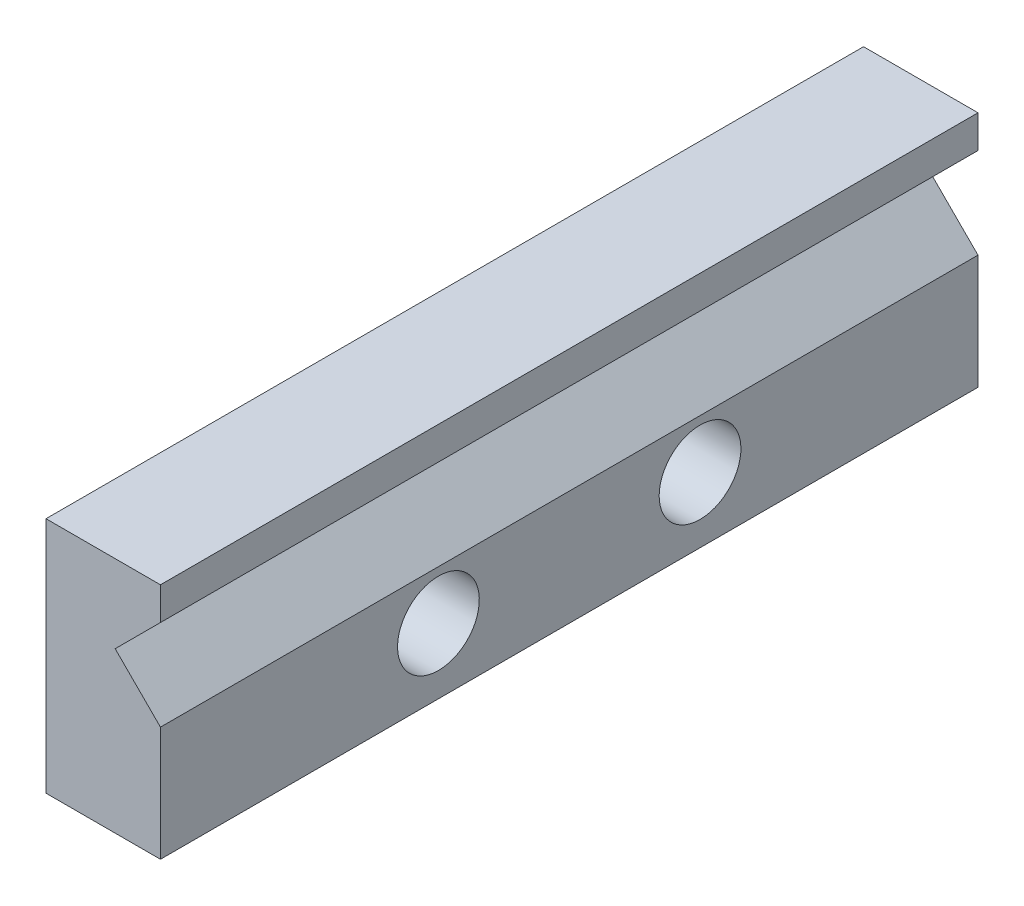
ISO-10303-21;
HEADER;
FILE_DESCRIPTION(('STEP AP214'),'2;1');
FILE_NAME('part.step','',(''),(''),'','','');
FILE_SCHEMA(('AUTOMOTIVE_DESIGN { 1 0 10303 214 1 1 1 1 }'));
ENDSEC;
DATA;
#1=APPLICATION_CONTEXT('core data for automotive mechanical design processes');
#2=APPLICATION_PROTOCOL_DEFINITION('international standard','automotive_design',2000,#1);
#3=PRODUCT_CONTEXT('',#1,'mechanical');
#4=PRODUCT('Part','Part','',(#3));
#5=PRODUCT_RELATED_PRODUCT_CATEGORY('part','',(#4));
#6=PRODUCT_DEFINITION_FORMATION('','',#4);
#7=PRODUCT_DEFINITION_CONTEXT('part definition',#1,'design');
#8=PRODUCT_DEFINITION('design','',#6,#7);
#9=PRODUCT_DEFINITION_SHAPE('','',#8);
#10=(LENGTH_UNIT() NAMED_UNIT(*) SI_UNIT(.MILLI.,.METRE.));
#11=(NAMED_UNIT(*) PLANE_ANGLE_UNIT() SI_UNIT($,.RADIAN.));
#12=(NAMED_UNIT(*) SI_UNIT($,.STERADIAN.) SOLID_ANGLE_UNIT());
#13=UNCERTAINTY_MEASURE_WITH_UNIT(LENGTH_MEASURE(1.E-05),#10,'distance_accuracy_value','');
#14=(GEOMETRIC_REPRESENTATION_CONTEXT(3) GLOBAL_UNCERTAINTY_ASSIGNED_CONTEXT((#13)) GLOBAL_UNIT_ASSIGNED_CONTEXT((#10,
#11,#12)) REPRESENTATION_CONTEXT('',''));
#15=CARTESIAN_POINT('',(0.,0.,0.));
#16=DIRECTION('',(0.,0.,1.));
#17=DIRECTION('',(1.,0.,0.));
#18=AXIS2_PLACEMENT_3D('',#15,#16,#17);
#19=CARTESIAN_POINT('',(-15.7134857516245,65.6371163031658,50.));
#20=DIRECTION('',(-1.,0.,0.));
#21=DIRECTION('',(0.,-1.,0.));
#22=AXIS2_PLACEMENT_3D('',#19,#20,#21);
#23=PLANE('',#22);
#24=DIRECTION('',(0.,1.,0.));
#25=VECTOR('',#24,1.);
#26=CARTESIAN_POINT('',(-15.7134857516245,65.6371163031658,0.));
#27=LINE('',#26,#25);
#28=CARTESIAN_POINT('',(-15.7134857516245,63.6371163031658,0.));
#29=VERTEX_POINT('',#28);
#30=CARTESIAN_POINT('',(-15.7134857516245,65.6371163031658,0.));
#31=VERTEX_POINT('',#30);
#32=EDGE_CURVE('E125',#29,#31,#27,.T.);
#33=ORIENTED_EDGE('',*,*,#32,.T.);
#34=DIRECTION('',(0.,0.,-1.));
#35=VECTOR('',#34,1.);
#36=CARTESIAN_POINT('',(-15.7134857516245,65.6371163031658,50.));
#37=LINE('',#36,#35);
#38=CARTESIAN_POINT('',(-15.7134857516245,65.6371163031658,50.));
#39=VERTEX_POINT('',#38);
#40=EDGE_CURVE('E11',#39,#31,#37,.T.);
#41=ORIENTED_EDGE('',*,*,#40,.F.);
#42=DIRECTION('',(0.,1.,0.));
#43=VECTOR('',#42,1.);
#44=CARTESIAN_POINT('',(-15.7134857516245,65.6371163031658,50.));
#45=LINE('',#44,#43);
#46=CARTESIAN_POINT('',(-15.7134857516245,63.6371163031658,50.));
#47=VERTEX_POINT('',#46);
#48=EDGE_CURVE('E138',#47,#39,#45,.T.);
#49=ORIENTED_EDGE('',*,*,#48,.F.);
#50=DIRECTION('',(0.,0.,-1.));
#51=VECTOR('',#50,1.);
#52=CARTESIAN_POINT('',(-15.7134857516245,63.6371163031658,50.));
#53=LINE('',#52,#51);
#54=EDGE_CURVE('E121',#47,#29,#53,.T.);
#55=ORIENTED_EDGE('',*,*,#54,.T.);
#56=EDGE_LOOP('',(#33,#41,#49,#55));
#57=FACE_BOUND('',#56,.T.);
#58=ADVANCED_FACE('F35',(#57),#23,.F.);
#59=CARTESIAN_POINT('',(-22.7134857516245,65.6371163031658,50.));
#60=DIRECTION('',(0.,-1.,0.));
#61=DIRECTION('',(0.,0.,-1.));
#62=AXIS2_PLACEMENT_3D('',#59,#60,#61);
#63=PLANE('',#62);
#64=DIRECTION('',(-1.,0.,0.));
#65=VECTOR('',#64,1.);
#66=CARTESIAN_POINT('',(-22.7134857516245,65.6371163031658,0.));
#67=LINE('',#66,#65);
#68=CARTESIAN_POINT('',(-22.7134857516245,65.6371163031658,0.));
#69=VERTEX_POINT('',#68);
#70=EDGE_CURVE('E128',#31,#69,#67,.T.);
#71=ORIENTED_EDGE('',*,*,#70,.T.);
#72=DIRECTION('',(0.,0.,-1.));
#73=VECTOR('',#72,1.);
#74=CARTESIAN_POINT('',(-22.7134857516245,65.6371163031658,50.));
#75=LINE('',#74,#73);
#76=CARTESIAN_POINT('',(-22.7134857516245,65.6371163031658,50.));
#77=VERTEX_POINT('',#76);
#78=EDGE_CURVE('E43',#77,#69,#75,.T.);
#79=ORIENTED_EDGE('',*,*,#78,.F.);
#80=DIRECTION('',(-1.,0.,0.));
#81=VECTOR('',#80,1.);
#82=CARTESIAN_POINT('',(-22.7134857516245,65.6371163031658,50.));
#83=LINE('',#82,#81);
#84=EDGE_CURVE('E91',#39,#77,#83,.T.);
#85=ORIENTED_EDGE('',*,*,#84,.F.);
#86=ORIENTED_EDGE('',*,*,#40,.T.);
#87=EDGE_LOOP('',(#71,#79,#85,#86));
#88=FACE_BOUND('',#87,.T.);
#89=ADVANCED_FACE('F178',(#88),#63,.F.);
#90=CARTESIAN_POINT('',(-22.7134857516245,51.0971163031658,50.));
#91=DIRECTION('',(1.,0.,0.));
#92=DIRECTION('',(0.,0.,-1.));
#93=AXIS2_PLACEMENT_3D('',#90,#91,#92);
#94=PLANE('',#93);
#95=CARTESIAN_POINT('',(-22.7134857516245,55.0971163031658,33.));
#96=DIRECTION('',(-1.,0.,0.));
#97=DIRECTION('',(0.,0.,1.));
#98=AXIS2_PLACEMENT_3D('',#95,#96,#97);
#99=CIRCLE('',#98,2.5);
#100=CARTESIAN_POINT('',(-22.7134857516245,55.0971163031658,35.5));
#101=VERTEX_POINT('',#100);
#102=EDGE_CURVE('E169',#101,#101,#99,.T.);
#103=ORIENTED_EDGE('',*,*,#102,.F.);
#104=EDGE_LOOP('',(#103));
#105=FACE_BOUND('',#104,.T.);
#106=CARTESIAN_POINT('',(-22.7134857516245,55.0971163031658,17.));
#107=DIRECTION('',(-1.,0.,0.));
#108=DIRECTION('',(0.,0.,1.));
#109=AXIS2_PLACEMENT_3D('',#106,#107,#108);
#110=CIRCLE('',#109,2.5);
#111=CARTESIAN_POINT('',(-22.7134857516245,55.0971163031658,19.5));
#112=VERTEX_POINT('',#111);
#113=EDGE_CURVE('E163',#112,#112,#110,.T.);
#114=ORIENTED_EDGE('',*,*,#113,.F.);
#115=EDGE_LOOP('',(#114));
#116=FACE_BOUND('',#115,.T.);
#117=DIRECTION('',(0.,-1.,0.));
#118=VECTOR('',#117,1.);
#119=CARTESIAN_POINT('',(-22.7134857516245,51.0971163031658,0.));
#120=LINE('',#119,#118);
#121=CARTESIAN_POINT('',(-22.7134857516245,51.0971163031658,0.));
#122=VERTEX_POINT('',#121);
#123=EDGE_CURVE('E131',#69,#122,#120,.T.);
#124=ORIENTED_EDGE('',*,*,#123,.T.);
#125=DIRECTION('',(0.,0.,-1.));
#126=VECTOR('',#125,1.);
#127=CARTESIAN_POINT('',(-22.7134857516245,51.0971163031658,50.));
#128=LINE('',#127,#126);
#129=CARTESIAN_POINT('',(-22.7134857516245,51.0971163031658,50.));
#130=VERTEX_POINT('',#129);
#131=EDGE_CURVE('E142',#130,#122,#128,.T.);
#132=ORIENTED_EDGE('',*,*,#131,.F.);
#133=DIRECTION('',(0.,-1.,0.));
#134=VECTOR('',#133,1.);
#135=CARTESIAN_POINT('',(-22.7134857516245,51.0971163031658,50.));
#136=LINE('',#135,#134);
#137=EDGE_CURVE('E150',#77,#130,#136,.T.);
#138=ORIENTED_EDGE('',*,*,#137,.F.);
#139=ORIENTED_EDGE('',*,*,#78,.T.);
#140=EDGE_LOOP('',(#124,#132,#138,#139));
#141=FACE_BOUND('',#140,.T.);
#142=ADVANCED_FACE('F148',(#105,#116,#141),#94,.F.);
#143=CARTESIAN_POINT('',(-15.7134857516245,51.0971163031658,50.));
#144=DIRECTION('',(0.,1.,0.));
#145=DIRECTION('',(0.,0.,1.));
#146=AXIS2_PLACEMENT_3D('',#143,#144,#145);
#147=PLANE('',#146);
#148=DIRECTION('',(1.,0.,0.));
#149=VECTOR('',#148,1.);
#150=CARTESIAN_POINT('',(-15.7134857516245,51.0971163031658,0.));
#151=LINE('',#150,#149);
#152=CARTESIAN_POINT('',(-15.7134857516245,51.0971163031658,0.));
#153=VERTEX_POINT('',#152);
#154=EDGE_CURVE('E133',#122,#153,#151,.T.);
#155=ORIENTED_EDGE('',*,*,#154,.T.);
#156=DIRECTION('',(0.,0.,-1.));
#157=VECTOR('',#156,1.);
#158=CARTESIAN_POINT('',(-15.7134857516245,51.0971163031658,50.));
#159=LINE('',#158,#157);
#160=CARTESIAN_POINT('',(-15.7134857516245,51.0971163031658,50.));
#161=VERTEX_POINT('',#160);
#162=EDGE_CURVE('E116',#161,#153,#159,.T.);
#163=ORIENTED_EDGE('',*,*,#162,.F.);
#164=DIRECTION('',(1.,0.,0.));
#165=VECTOR('',#164,1.);
#166=CARTESIAN_POINT('',(-15.7134857516245,51.0971163031658,50.));
#167=LINE('',#166,#165);
#168=EDGE_CURVE('E107',#130,#161,#167,.T.);
#169=ORIENTED_EDGE('',*,*,#168,.F.);
#170=ORIENTED_EDGE('',*,*,#131,.T.);
#171=EDGE_LOOP('',(#155,#163,#169,#170));
#172=FACE_BOUND('',#171,.T.);
#173=ADVANCED_FACE('F156',(#172),#147,.F.);
#174=CARTESIAN_POINT('',(-15.7134857516245,58.0971163031658,50.));
#175=DIRECTION('',(-1.,0.,0.));
#176=DIRECTION('',(0.,-1.,0.));
#177=AXIS2_PLACEMENT_3D('',#174,#175,#176);
#178=PLANE('',#177);
#179=CARTESIAN_POINT('',(-15.7134857516245,55.0971163031658,33.));
#180=DIRECTION('',(-1.,0.,0.));
#181=DIRECTION('',(0.,-1.,0.));
#182=AXIS2_PLACEMENT_3D('',#179,#180,#181);
#183=CIRCLE('',#182,2.5);
#184=CARTESIAN_POINT('',(-15.7134857516245,52.5971163031658,33.));
#185=VERTEX_POINT('',#184);
#186=EDGE_CURVE('E166',#185,#185,#183,.F.);
#187=ORIENTED_EDGE('',*,*,#186,.F.);
#188=EDGE_LOOP('',(#187));
#189=FACE_BOUND('',#188,.T.);
#190=CARTESIAN_POINT('',(-15.7134857516245,55.0971163031658,17.));
#191=DIRECTION('',(-1.,0.,0.));
#192=DIRECTION('',(0.,-1.,0.));
#193=AXIS2_PLACEMENT_3D('',#190,#191,#192);
#194=CIRCLE('',#193,2.5);
#195=CARTESIAN_POINT('',(-15.7134857516245,52.5971163031658,17.));
#196=VERTEX_POINT('',#195);
#197=EDGE_CURVE('E129',#196,#196,#194,.F.);
#198=ORIENTED_EDGE('',*,*,#197,.F.);
#199=EDGE_LOOP('',(#198));
#200=FACE_BOUND('',#199,.T.);
#201=DIRECTION('',(0.,1.,0.));
#202=VECTOR('',#201,1.);
#203=CARTESIAN_POINT('',(-15.7134857516245,58.0971163031658,0.));
#204=LINE('',#203,#202);
#205=CARTESIAN_POINT('',(-15.7134857516245,58.0971163031658,0.));
#206=VERTEX_POINT('',#205);
#207=EDGE_CURVE('E115',#153,#206,#204,.T.);
#208=ORIENTED_EDGE('',*,*,#207,.T.);
#209=DIRECTION('',(0.,0.,-1.));
#210=VECTOR('',#209,1.);
#211=CARTESIAN_POINT('',(-15.7134857516245,58.0971163031658,50.));
#212=LINE('',#211,#210);
#213=CARTESIAN_POINT('',(-15.7134857516245,58.0971163031658,50.));
#214=VERTEX_POINT('',#213);
#215=EDGE_CURVE('E112',#214,#206,#212,.T.);
#216=ORIENTED_EDGE('',*,*,#215,.F.);
#217=DIRECTION('',(0.,1.,0.));
#218=VECTOR('',#217,1.);
#219=CARTESIAN_POINT('',(-15.7134857516245,58.0971163031658,50.));
#220=LINE('',#219,#218);
#221=EDGE_CURVE('E101',#161,#214,#220,.T.);
#222=ORIENTED_EDGE('',*,*,#221,.F.);
#223=ORIENTED_EDGE('',*,*,#162,.T.);
#224=EDGE_LOOP('',(#208,#216,#222,#223));
#225=FACE_BOUND('',#224,.T.);
#226=ADVANCED_FACE('F113',(#189,#200,#225),#178,.F.);
#227=CARTESIAN_POINT('',(-18.4834857516245,60.8671171277931,50.));
#228=DIRECTION('',(-0.707106886439154,-0.707106675933926,0.));
#229=DIRECTION('',(0.707106675933926,-0.707106886439154,0.));
#230=AXIS2_PLACEMENT_3D('',#227,#228,#229);
#231=PLANE('',#230);
#232=DIRECTION('',(-0.707106675933926,0.707106886439154,0.));
#233=VECTOR('',#232,1.);
#234=CARTESIAN_POINT('',(-18.4834857516245,60.8671171277931,0.));
#235=LINE('',#234,#233);
#236=CARTESIAN_POINT('',(-18.4834857516245,60.8671171277931,0.));
#237=VERTEX_POINT('',#236);
#238=EDGE_CURVE('E77',#206,#237,#235,.T.);
#239=ORIENTED_EDGE('',*,*,#238,.T.);
#240=DIRECTION('',(0.,0.,-1.));
#241=VECTOR('',#240,1.);
#242=CARTESIAN_POINT('',(-18.4834857516245,60.8671171277931,50.));
#243=LINE('',#242,#241);
#244=CARTESIAN_POINT('',(-18.4834857516245,60.8671171277931,50.));
#245=VERTEX_POINT('',#244);
#246=EDGE_CURVE('E117',#245,#237,#243,.T.);
#247=ORIENTED_EDGE('',*,*,#246,.F.);
#248=DIRECTION('',(-0.707106675933926,0.707106886439154,0.));
#249=VECTOR('',#248,1.);
#250=CARTESIAN_POINT('',(-18.4834857516245,60.8671171277931,50.));
#251=LINE('',#250,#249);
#252=EDGE_CURVE('E105',#214,#245,#251,.T.);
#253=ORIENTED_EDGE('',*,*,#252,.F.);
#254=ORIENTED_EDGE('',*,*,#215,.T.);
#255=EDGE_LOOP('',(#239,#247,#253,#254));
#256=FACE_BOUND('',#255,.T.);
#257=ADVANCED_FACE('F119',(#256),#231,.F.);
#258=CARTESIAN_POINT('',(-15.7134857516245,63.6371163031658,50.));
#259=DIRECTION('',(-0.707106675933894,0.707106886439185,0.));
#260=DIRECTION('',(-0.707106886439185,-0.707106675933894,0.));
#261=AXIS2_PLACEMENT_3D('',#258,#259,#260);
#262=PLANE('',#261);
#263=DIRECTION('',(0.707106886439185,0.707106675933894,0.));
#264=VECTOR('',#263,1.);
#265=CARTESIAN_POINT('',(-15.7134857516245,63.6371163031658,0.));
#266=LINE('',#265,#264);
#267=EDGE_CURVE('E83',#237,#29,#266,.T.);
#268=ORIENTED_EDGE('',*,*,#267,.T.);
#269=ORIENTED_EDGE('',*,*,#54,.F.);
#270=DIRECTION('',(0.707106886439185,0.707106675933894,0.));
#271=VECTOR('',#270,1.);
#272=CARTESIAN_POINT('',(-15.7134857516245,63.6371163031658,50.));
#273=LINE('',#272,#271);
#274=EDGE_CURVE('E51',#245,#47,#273,.T.);
#275=ORIENTED_EDGE('',*,*,#274,.F.);
#276=ORIENTED_EDGE('',*,*,#246,.T.);
#277=EDGE_LOOP('',(#268,#269,#275,#276));
#278=FACE_BOUND('',#277,.T.);
#279=ADVANCED_FACE('F195',(#278),#262,.F.);
#280=CARTESIAN_POINT('',(0.,0.,50.));
#281=DIRECTION('',(0.,0.,-1.));
#282=DIRECTION('',(-1.,0.,0.));
#283=AXIS2_PLACEMENT_3D('',#280,#281,#282);
#284=PLANE('',#283);
#285=ORIENTED_EDGE('',*,*,#48,.T.);
#286=ORIENTED_EDGE('',*,*,#84,.T.);
#287=ORIENTED_EDGE('',*,*,#137,.T.);
#288=ORIENTED_EDGE('',*,*,#168,.T.);
#289=ORIENTED_EDGE('',*,*,#221,.T.);
#290=ORIENTED_EDGE('',*,*,#252,.T.);
#291=ORIENTED_EDGE('',*,*,#274,.T.);
#292=EDGE_LOOP('',(#285,#286,#287,#288,#289,#290,#291));
#293=FACE_BOUND('',#292,.T.);
#294=ADVANCED_FACE('F103',(#293),#284,.F.);
#295=CARTESIAN_POINT('',(0.,0.,0.));
#296=DIRECTION('',(0.,0.,-1.));
#297=DIRECTION('',(-1.,0.,0.));
#298=AXIS2_PLACEMENT_3D('',#295,#296,#297);
#299=PLANE('',#298);
#300=ORIENTED_EDGE('',*,*,#32,.F.);
#301=ORIENTED_EDGE('',*,*,#267,.F.);
#302=ORIENTED_EDGE('',*,*,#238,.F.);
#303=ORIENTED_EDGE('',*,*,#207,.F.);
#304=ORIENTED_EDGE('',*,*,#154,.F.);
#305=ORIENTED_EDGE('',*,*,#123,.F.);
#306=ORIENTED_EDGE('',*,*,#70,.F.);
#307=EDGE_LOOP('',(#300,#301,#302,#303,#304,#305,#306));
#308=FACE_BOUND('',#307,.T.);
#309=ADVANCED_FACE('F154',(#308),#299,.T.);
#310=CARTESIAN_POINT('',(-15.7124857516245,55.0971163031658,17.));
#311=DIRECTION('',(-1.,0.,0.));
#312=DIRECTION('',(0.,0.,1.));
#313=AXIS2_PLACEMENT_3D('',#310,#311,#312);
#314=CYLINDRICAL_SURFACE('',#313,2.5);
#315=ORIENTED_EDGE('',*,*,#113,.T.);
#316=EDGE_LOOP('',(#315));
#317=FACE_BOUND('',#316,.T.);
#318=ORIENTED_EDGE('',*,*,#197,.T.);
#319=EDGE_LOOP('',(#318));
#320=FACE_BOUND('',#319,.T.);
#321=ADVANCED_FACE('F182',(#317,#320),#314,.F.);
#322=CARTESIAN_POINT('',(-15.7124857516245,55.0971163031658,33.));
#323=DIRECTION('',(-1.,0.,0.));
#324=DIRECTION('',(0.,0.,1.));
#325=AXIS2_PLACEMENT_3D('',#322,#323,#324);
#326=CYLINDRICAL_SURFACE('',#325,2.5);
#327=ORIENTED_EDGE('',*,*,#102,.T.);
#328=EDGE_LOOP('',(#327));
#329=FACE_BOUND('',#328,.T.);
#330=ORIENTED_EDGE('',*,*,#186,.T.);
#331=EDGE_LOOP('',(#330));
#332=FACE_BOUND('',#331,.T.);
#333=ADVANCED_FACE('F173',(#329,#332),#326,.F.);
#334=CLOSED_SHELL('',(#58,#89,#142,#173,#226,#257,#279,#294,#309,#321,#333));
#335=MANIFOLD_SOLID_BREP('B2',#334);
#336=ADVANCED_BREP_SHAPE_REPRESENTATION('',(#18,#335),#14);
#337=SHAPE_DEFINITION_REPRESENTATION(#9,#336);
ENDSEC;
END-ISO-10303-21;
